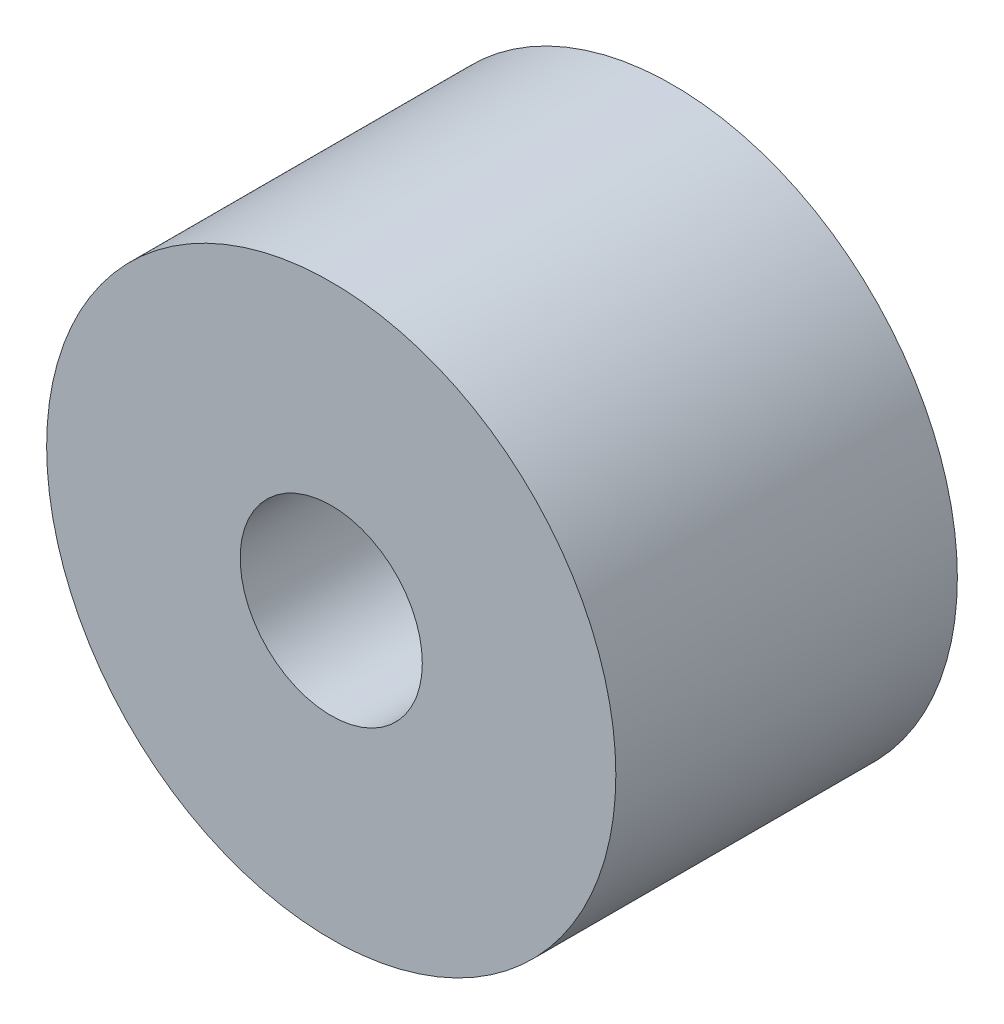
ISO-10303-21;
HEADER;
FILE_DESCRIPTION(('STEP AP214'),'2;1');
FILE_NAME('part.step','',(''),(''),'','','');
FILE_SCHEMA(('AUTOMOTIVE_DESIGN { 1 0 10303 214 1 1 1 1 }'));
ENDSEC;
DATA;
#1=APPLICATION_CONTEXT('core data for automotive mechanical design processes');
#2=APPLICATION_PROTOCOL_DEFINITION('international standard','automotive_design',2000,#1);
#3=PRODUCT_CONTEXT('',#1,'mechanical');
#4=PRODUCT('Part','Part','',(#3));
#5=PRODUCT_RELATED_PRODUCT_CATEGORY('part','',(#4));
#6=PRODUCT_DEFINITION_FORMATION('','',#4);
#7=PRODUCT_DEFINITION_CONTEXT('part definition',#1,'design');
#8=PRODUCT_DEFINITION('design','',#6,#7);
#9=PRODUCT_DEFINITION_SHAPE('','',#8);
#10=(LENGTH_UNIT() NAMED_UNIT(*) SI_UNIT(.MILLI.,.METRE.));
#11=(NAMED_UNIT(*) PLANE_ANGLE_UNIT() SI_UNIT($,.RADIAN.));
#12=(NAMED_UNIT(*) SI_UNIT($,.STERADIAN.) SOLID_ANGLE_UNIT());
#13=UNCERTAINTY_MEASURE_WITH_UNIT(LENGTH_MEASURE(1.E-05),#10,'distance_accuracy_value','');
#14=(GEOMETRIC_REPRESENTATION_CONTEXT(3) GLOBAL_UNCERTAINTY_ASSIGNED_CONTEXT((#13)) GLOBAL_UNIT_ASSIGNED_CONTEXT((#10,
#11,#12)) REPRESENTATION_CONTEXT('',''));
#15=CARTESIAN_POINT('',(0.,0.,0.));
#16=DIRECTION('',(0.,0.,1.));
#17=DIRECTION('',(1.,0.,0.));
#18=AXIS2_PLACEMENT_3D('',#15,#16,#17);
#19=CARTESIAN_POINT('',(0.,0.,15.));
#20=DIRECTION('',(0.,0.,1.));
#21=DIRECTION('',(1.,0.,0.));
#22=AXIS2_PLACEMENT_3D('',#19,#20,#21);
#23=PLANE('',#22);
#24=CARTESIAN_POINT('',(0.,0.,15.));
#25=DIRECTION('',(0.,0.,1.));
#26=DIRECTION('',(1.,0.,0.));
#27=AXIS2_PLACEMENT_3D('',#24,#25,#26);
#28=CIRCLE('',#27,12.5);
#29=CARTESIAN_POINT('',(12.5,0.,15.));
#30=VERTEX_POINT('',#29);
#31=EDGE_CURVE('E10',#30,#30,#28,.T.);
#32=ORIENTED_EDGE('',*,*,#31,.T.);
#33=EDGE_LOOP('',(#32));
#34=FACE_BOUND('',#33,.T.);
#35=CARTESIAN_POINT('',(0.,0.,15.));
#36=DIRECTION('',(0.,0.,1.));
#37=DIRECTION('',(1.,0.,0.));
#38=AXIS2_PLACEMENT_3D('',#35,#36,#37);
#39=CIRCLE('',#38,4.);
#40=CARTESIAN_POINT('',(4.,0.,15.));
#41=VERTEX_POINT('',#40);
#42=EDGE_CURVE('E48',#41,#41,#39,.T.);
#43=ORIENTED_EDGE('',*,*,#42,.F.);
#44=EDGE_LOOP('',(#43));
#45=FACE_BOUND('',#44,.T.);
#46=ADVANCED_FACE('F37',(#34,#45),#23,.T.);
#47=CARTESIAN_POINT('',(0.,0.,0.));
#48=DIRECTION('',(0.,0.,1.));
#49=DIRECTION('',(1.,0.,0.));
#50=AXIS2_PLACEMENT_3D('',#47,#48,#49);
#51=PLANE('',#50);
#52=CARTESIAN_POINT('',(0.,0.,0.));
#53=DIRECTION('',(0.,0.,1.));
#54=DIRECTION('',(1.,0.,0.));
#55=AXIS2_PLACEMENT_3D('',#52,#53,#54);
#56=CIRCLE('',#55,12.5);
#57=CARTESIAN_POINT('',(12.5,0.,0.));
#58=VERTEX_POINT('',#57);
#59=EDGE_CURVE('E41',#58,#58,#56,.T.);
#60=ORIENTED_EDGE('',*,*,#59,.F.);
#61=EDGE_LOOP('',(#60));
#62=FACE_BOUND('',#61,.T.);
#63=CARTESIAN_POINT('',(0.,0.,0.));
#64=DIRECTION('',(0.,0.,1.));
#65=DIRECTION('',(1.,0.,0.));
#66=AXIS2_PLACEMENT_3D('',#63,#64,#65);
#67=CIRCLE('',#66,4.);
#68=CARTESIAN_POINT('',(4.,0.,0.));
#69=VERTEX_POINT('',#68);
#70=EDGE_CURVE('E50',#69,#69,#67,.T.);
#71=ORIENTED_EDGE('',*,*,#70,.T.);
#72=EDGE_LOOP('',(#71));
#73=FACE_BOUND('',#72,.T.);
#74=ADVANCED_FACE('F60',(#62,#73),#51,.F.);
#75=CARTESIAN_POINT('',(0.,0.,15.));
#76=DIRECTION('',(0.,0.,-1.));
#77=DIRECTION('',(-1.,0.,0.));
#78=AXIS2_PLACEMENT_3D('',#75,#76,#77);
#79=CYLINDRICAL_SURFACE('',#78,12.5);
#80=ORIENTED_EDGE('',*,*,#31,.F.);
#81=EDGE_LOOP('',(#80));
#82=FACE_BOUND('',#81,.T.);
#83=ORIENTED_EDGE('',*,*,#59,.T.);
#84=EDGE_LOOP('',(#83));
#85=FACE_BOUND('',#84,.T.);
#86=ADVANCED_FACE('F39',(#82,#85),#79,.T.);
#87=CARTESIAN_POINT('',(0.,0.,15.));
#88=DIRECTION('',(0.,0.,-1.));
#89=DIRECTION('',(-1.,0.,0.));
#90=AXIS2_PLACEMENT_3D('',#87,#88,#89);
#91=CYLINDRICAL_SURFACE('',#90,4.);
#92=ORIENTED_EDGE('',*,*,#42,.T.);
#93=EDGE_LOOP('',(#92));
#94=FACE_BOUND('',#93,.T.);
#95=ORIENTED_EDGE('',*,*,#70,.F.);
#96=EDGE_LOOP('',(#95));
#97=FACE_BOUND('',#96,.T.);
#98=ADVANCED_FACE('F56',(#94,#97),#91,.F.);
#99=CLOSED_SHELL('',(#46,#74,#86,#98));
#100=MANIFOLD_SOLID_BREP('B2',#99);
#101=ADVANCED_BREP_SHAPE_REPRESENTATION('',(#18,#100),#14);
#102=SHAPE_DEFINITION_REPRESENTATION(#9,#101);
ENDSEC;
END-ISO-10303-21;
